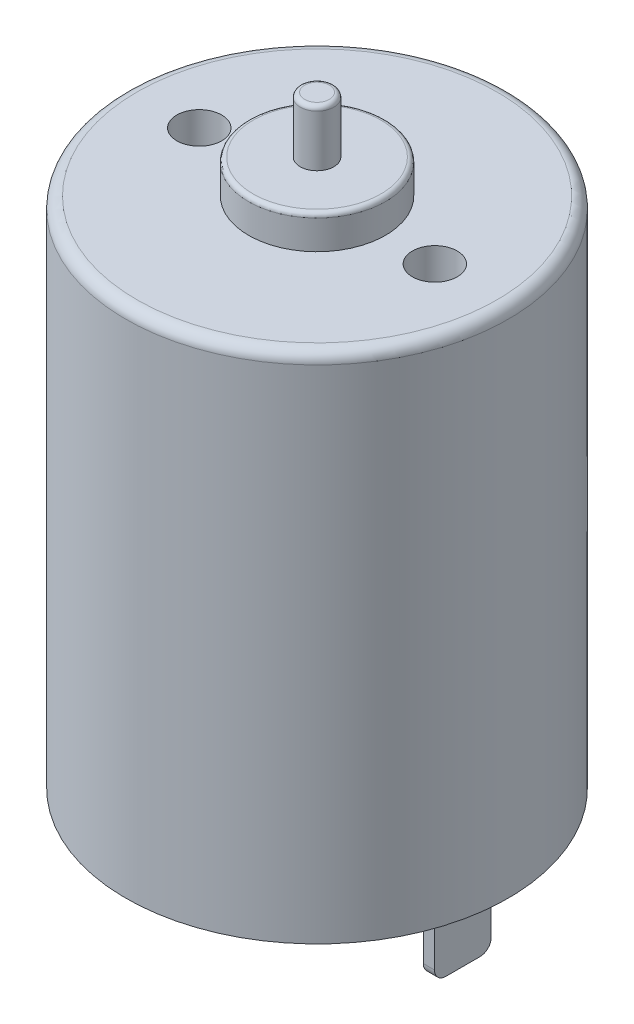
ISO-10303-21;
HEADER;
FILE_DESCRIPTION(('STEP AP214'),'2;1');
FILE_NAME('part.step','',(''),(''),'','','');
FILE_SCHEMA(('AUTOMOTIVE_DESIGN { 1 0 10303 214 1 1 1 1 }'));
ENDSEC;
DATA;
#1=APPLICATION_CONTEXT('core data for automotive mechanical design processes');
#2=APPLICATION_PROTOCOL_DEFINITION('international standard','automotive_design',2000,#1);
#3=PRODUCT_CONTEXT('',#1,'mechanical');
#4=PRODUCT('Part','Part','',(#3));
#5=PRODUCT_RELATED_PRODUCT_CATEGORY('part','',(#4));
#6=PRODUCT_DEFINITION_FORMATION('','',#4);
#7=PRODUCT_DEFINITION_CONTEXT('part definition',#1,'design');
#8=PRODUCT_DEFINITION('design','',#6,#7);
#9=PRODUCT_DEFINITION_SHAPE('','',#8);
#10=(LENGTH_UNIT() NAMED_UNIT(*) SI_UNIT(.MILLI.,.METRE.));
#11=(NAMED_UNIT(*) PLANE_ANGLE_UNIT() SI_UNIT($,.RADIAN.));
#12=(NAMED_UNIT(*) SI_UNIT($,.STERADIAN.) SOLID_ANGLE_UNIT());
#13=UNCERTAINTY_MEASURE_WITH_UNIT(LENGTH_MEASURE(1.E-05),#10,'distance_accuracy_value','');
#14=(GEOMETRIC_REPRESENTATION_CONTEXT(3) GLOBAL_UNCERTAINTY_ASSIGNED_CONTEXT((#13)) GLOBAL_UNIT_ASSIGNED_CONTEXT((#10,
#11,#12)) REPRESENTATION_CONTEXT('',''));
#15=CARTESIAN_POINT('',(0.,0.,0.));
#16=DIRECTION('',(0.,0.,1.));
#17=DIRECTION('',(1.,0.,0.));
#18=AXIS2_PLACEMENT_3D('',#15,#16,#17);
#19=CARTESIAN_POINT('',(0.,-3.65,0.));
#20=DIRECTION('',(0.,-1.,0.));
#21=DIRECTION('',(0.,0.,-1.));
#22=AXIS2_PLACEMENT_3D('',#19,#20,#21);
#23=PLANE('',#22);
#24=DIRECTION('',(-1.,0.,0.));
#25=VECTOR('',#24,1.);
#26=CARTESIAN_POINT('',(6.5,-3.65,0.765));
#27=LINE('',#26,#25);
#28=CARTESIAN_POINT('',(6.5,-3.65,0.765));
#29=VERTEX_POINT('',#28);
#30=CARTESIAN_POINT('',(6.,-3.65,0.765));
#31=VERTEX_POINT('',#30);
#32=EDGE_CURVE('E136',#29,#31,#27,.T.);
#33=ORIENTED_EDGE('',*,*,#32,.T.);
#34=DIRECTION('',(0.,0.,1.));
#35=VECTOR('',#34,1.);
#36=CARTESIAN_POINT('',(6.,-3.65,-0.765));
#37=LINE('',#36,#35);
#38=CARTESIAN_POINT('',(6.,-3.65,-0.765));
#39=VERTEX_POINT('',#38);
#40=EDGE_CURVE('E138',#39,#31,#37,.T.);
#41=ORIENTED_EDGE('',*,*,#40,.F.);
#42=DIRECTION('',(1.,0.,0.));
#43=VECTOR('',#42,1.);
#44=CARTESIAN_POINT('',(6.,-3.65,-0.765));
#45=LINE('',#44,#43);
#46=CARTESIAN_POINT('',(6.5,-3.65,-0.765));
#47=VERTEX_POINT('',#46);
#48=EDGE_CURVE('E11',#39,#47,#45,.T.);
#49=ORIENTED_EDGE('',*,*,#48,.T.);
#50=DIRECTION('',(0.,0.,-1.));
#51=VECTOR('',#50,1.);
#52=CARTESIAN_POINT('',(6.5,-3.65,0.765));
#53=LINE('',#52,#51);
#54=EDGE_CURVE('E141',#29,#47,#53,.T.);
#55=ORIENTED_EDGE('',*,*,#54,.F.);
#56=EDGE_LOOP('',(#33,#41,#49,#55));
#57=FACE_BOUND('',#56,.T.);
#58=ADVANCED_FACE('F17',(#57),#23,.T.);
#59=CARTESIAN_POINT('',(-30.75138,-3.15,-0.765));
#60=DIRECTION('',(1.,0.,0.));
#61=DIRECTION('',(0.,-1.,0.));
#62=AXIS2_PLACEMENT_3D('',#59,#60,#61);
#63=CYLINDRICAL_SURFACE('',#62,0.5);
#64=CARTESIAN_POINT('',(6.5,-3.15,-0.765));
#65=DIRECTION('',(-1.,0.,0.));
#66=DIRECTION('',(0.,0.,-1.));
#67=AXIS2_PLACEMENT_3D('',#64,#65,#66);
#68=CIRCLE('',#67,0.5);
#69=CARTESIAN_POINT('',(6.5,-3.15,-1.265));
#70=VERTEX_POINT('',#69);
#71=EDGE_CURVE('E251',#70,#47,#68,.T.);
#72=ORIENTED_EDGE('',*,*,#71,.T.);
#73=ORIENTED_EDGE('',*,*,#48,.F.);
#74=CARTESIAN_POINT('',(6.,-3.15,-0.765));
#75=DIRECTION('',(1.,0.,0.));
#76=DIRECTION('',(0.,-1.,0.));
#77=AXIS2_PLACEMENT_3D('',#74,#75,#76);
#78=CIRCLE('',#77,0.5);
#79=CARTESIAN_POINT('',(6.,-3.15,-1.265));
#80=VERTEX_POINT('',#79);
#81=EDGE_CURVE('E155',#39,#80,#78,.T.);
#82=ORIENTED_EDGE('',*,*,#81,.T.);
#83=DIRECTION('',(-1.,0.,0.));
#84=VECTOR('',#83,1.);
#85=CARTESIAN_POINT('',(6.5,-3.15,-1.265));
#86=LINE('',#85,#84);
#87=EDGE_CURVE('E27',#70,#80,#86,.T.);
#88=ORIENTED_EDGE('',*,*,#87,.F.);
#89=EDGE_LOOP('',(#72,#73,#82,#88));
#90=FACE_BOUND('',#89,.T.);
#91=ADVANCED_FACE('F426',(#90),#63,.T.);
#92=CARTESIAN_POINT('',(6.,0.,-1.265));
#93=DIRECTION('',(0.,0.,-1.));
#94=DIRECTION('',(0.,-1.,0.));
#95=AXIS2_PLACEMENT_3D('',#92,#93,#94);
#96=PLANE('',#95);
#97=ORIENTED_EDGE('',*,*,#87,.T.);
#98=DIRECTION('',(0.,1.,0.));
#99=VECTOR('',#98,1.);
#100=CARTESIAN_POINT('',(6.,-3.15,-1.265));
#101=LINE('',#100,#99);
#102=CARTESIAN_POINT('',(6.,0.,-1.265));
#103=VERTEX_POINT('',#102);
#104=EDGE_CURVE('E171',#80,#103,#101,.T.);
#105=ORIENTED_EDGE('',*,*,#104,.T.);
#106=DIRECTION('',(-1.,0.,0.));
#107=VECTOR('',#106,1.);
#108=CARTESIAN_POINT('',(6.5,0.,-1.265));
#109=LINE('',#108,#107);
#110=CARTESIAN_POINT('',(6.5,0.,-1.265));
#111=VERTEX_POINT('',#110);
#112=EDGE_CURVE('E314',#111,#103,#109,.T.);
#113=ORIENTED_EDGE('',*,*,#112,.F.);
#114=DIRECTION('',(0.,1.,0.));
#115=VECTOR('',#114,1.);
#116=CARTESIAN_POINT('',(6.5,-3.15,-1.265));
#117=LINE('',#116,#115);
#118=EDGE_CURVE('E245',#70,#111,#117,.T.);
#119=ORIENTED_EDGE('',*,*,#118,.F.);
#120=EDGE_LOOP('',(#97,#105,#113,#119));
#121=FACE_BOUND('',#120,.T.);
#122=ADVANCED_FACE('F431',(#121),#96,.T.);
#123=CARTESIAN_POINT('',(6.5,0.,-1.265));
#124=DIRECTION('',(1.,0.,0.));
#125=DIRECTION('',(0.,1.,0.));
#126=AXIS2_PLACEMENT_3D('',#123,#124,#125);
#127=PLANE('',#126);
#128=CARTESIAN_POINT('',(6.5,-3.15,0.765));
#129=DIRECTION('',(-1.,0.,0.));
#130=DIRECTION('',(0.,-1.,0.));
#131=AXIS2_PLACEMENT_3D('',#128,#129,#130);
#132=CIRCLE('',#131,0.5);
#133=CARTESIAN_POINT('',(6.5,-3.15,1.265));
#134=VERTEX_POINT('',#133);
#135=EDGE_CURVE('E147',#29,#134,#132,.T.);
#136=ORIENTED_EDGE('',*,*,#135,.F.);
#137=ORIENTED_EDGE('',*,*,#54,.T.);
#138=ORIENTED_EDGE('',*,*,#71,.F.);
#139=ORIENTED_EDGE('',*,*,#118,.T.);
#140=DIRECTION('',(0.,0.,-1.));
#141=VECTOR('',#140,1.);
#142=CARTESIAN_POINT('',(6.5,0.,1.265));
#143=LINE('',#142,#141);
#144=CARTESIAN_POINT('',(6.5,0.,1.265));
#145=VERTEX_POINT('',#144);
#146=EDGE_CURVE('E339',#145,#111,#143,.T.);
#147=ORIENTED_EDGE('',*,*,#146,.F.);
#148=DIRECTION('',(0.,1.,0.));
#149=VECTOR('',#148,1.);
#150=CARTESIAN_POINT('',(6.5,-3.15,1.265));
#151=LINE('',#150,#149);
#152=EDGE_CURVE('E328',#134,#145,#151,.T.);
#153=ORIENTED_EDGE('',*,*,#152,.F.);
#154=EDGE_LOOP('',(#136,#137,#138,#139,#147,#153));
#155=FACE_BOUND('',#154,.T.);
#156=ADVANCED_FACE('F437',(#155),#127,.T.);
#157=CARTESIAN_POINT('',(6.5,0.,1.265));
#158=DIRECTION('',(0.,0.,1.));
#159=DIRECTION('',(1.,0.,0.));
#160=AXIS2_PLACEMENT_3D('',#157,#158,#159);
#161=PLANE('',#160);
#162=DIRECTION('',(1.,0.,0.));
#163=VECTOR('',#162,1.);
#164=CARTESIAN_POINT('',(6.,-3.15,1.265));
#165=LINE('',#164,#163);
#166=CARTESIAN_POINT('',(6.,-3.15,1.265));
#167=VERTEX_POINT('',#166);
#168=EDGE_CURVE('E160',#167,#134,#165,.T.);
#169=ORIENTED_EDGE('',*,*,#168,.T.);
#170=ORIENTED_EDGE('',*,*,#152,.T.);
#171=DIRECTION('',(1.,0.,0.));
#172=VECTOR('',#171,1.);
#173=CARTESIAN_POINT('',(6.,0.,1.265));
#174=LINE('',#173,#172);
#175=CARTESIAN_POINT('',(6.,0.,1.265));
#176=VERTEX_POINT('',#175);
#177=EDGE_CURVE('E177',#176,#145,#174,.T.);
#178=ORIENTED_EDGE('',*,*,#177,.F.);
#179=DIRECTION('',(0.,1.,0.));
#180=VECTOR('',#179,1.);
#181=CARTESIAN_POINT('',(6.,-3.15,1.265));
#182=LINE('',#181,#180);
#183=EDGE_CURVE('E163',#167,#176,#182,.T.);
#184=ORIENTED_EDGE('',*,*,#183,.F.);
#185=EDGE_LOOP('',(#169,#170,#178,#184));
#186=FACE_BOUND('',#185,.T.);
#187=ADVANCED_FACE('F481',(#186),#161,.T.);
#188=CARTESIAN_POINT('',(30.75138,-3.15,0.765));
#189=DIRECTION('',(-1.,0.,0.));
#190=DIRECTION('',(0.,-1.,0.));
#191=AXIS2_PLACEMENT_3D('',#188,#189,#190);
#192=CYLINDRICAL_SURFACE('',#191,0.5);
#193=CARTESIAN_POINT('',(6.,-3.15,0.765));
#194=DIRECTION('',(1.,0.,0.));
#195=DIRECTION('',(0.,0.,1.));
#196=AXIS2_PLACEMENT_3D('',#193,#194,#195);
#197=CIRCLE('',#196,0.5);
#198=EDGE_CURVE('E153',#167,#31,#197,.T.);
#199=ORIENTED_EDGE('',*,*,#198,.T.);
#200=ORIENTED_EDGE('',*,*,#32,.F.);
#201=ORIENTED_EDGE('',*,*,#135,.T.);
#202=ORIENTED_EDGE('',*,*,#168,.F.);
#203=EDGE_LOOP('',(#199,#200,#201,#202));
#204=FACE_BOUND('',#203,.T.);
#205=ADVANCED_FACE('F158',(#204),#192,.T.);
#206=CARTESIAN_POINT('',(6.,0.,1.265));
#207=DIRECTION('',(-1.,0.,0.));
#208=DIRECTION('',(0.,0.,1.));
#209=AXIS2_PLACEMENT_3D('',#206,#207,#208);
#210=PLANE('',#209);
#211=ORIENTED_EDGE('',*,*,#198,.F.);
#212=ORIENTED_EDGE('',*,*,#183,.T.);
#213=DIRECTION('',(0.,0.,1.));
#214=VECTOR('',#213,1.);
#215=CARTESIAN_POINT('',(6.,0.,-1.265));
#216=LINE('',#215,#214);
#217=EDGE_CURVE('E282',#103,#176,#216,.T.);
#218=ORIENTED_EDGE('',*,*,#217,.F.);
#219=ORIENTED_EDGE('',*,*,#104,.F.);
#220=ORIENTED_EDGE('',*,*,#81,.F.);
#221=ORIENTED_EDGE('',*,*,#40,.T.);
#222=EDGE_LOOP('',(#211,#212,#218,#219,#220,#221));
#223=FACE_BOUND('',#222,.T.);
#224=ADVANCED_FACE('F151',(#223),#210,.T.);
#225=CARTESIAN_POINT('',(-6.,0.,1.265));
#226=DIRECTION('',(0.,0.,1.));
#227=DIRECTION('',(1.,0.,0.));
#228=AXIS2_PLACEMENT_3D('',#225,#226,#227);
#229=PLANE('',#228);
#230=DIRECTION('',(1.,0.,0.));
#231=VECTOR('',#230,1.);
#232=CARTESIAN_POINT('',(-6.5,-3.15,1.265));
#233=LINE('',#232,#231);
#234=CARTESIAN_POINT('',(-6.5,-3.15,1.265));
#235=VERTEX_POINT('',#234);
#236=CARTESIAN_POINT('',(-6.,-3.15,1.265));
#237=VERTEX_POINT('',#236);
#238=EDGE_CURVE('E212',#235,#237,#233,.T.);
#239=ORIENTED_EDGE('',*,*,#238,.T.);
#240=DIRECTION('',(0.,1.,0.));
#241=VECTOR('',#240,1.);
#242=CARTESIAN_POINT('',(-6.,-3.15,1.265));
#243=LINE('',#242,#241);
#244=CARTESIAN_POINT('',(-6.,0.,1.265));
#245=VERTEX_POINT('',#244);
#246=EDGE_CURVE('E201',#237,#245,#243,.T.);
#247=ORIENTED_EDGE('',*,*,#246,.T.);
#248=DIRECTION('',(1.,0.,0.));
#249=VECTOR('',#248,1.);
#250=CARTESIAN_POINT('',(-6.5,0.,1.265));
#251=LINE('',#250,#249);
#252=CARTESIAN_POINT('',(-6.5,0.,1.265));
#253=VERTEX_POINT('',#252);
#254=EDGE_CURVE('E286',#253,#245,#251,.T.);
#255=ORIENTED_EDGE('',*,*,#254,.F.);
#256=DIRECTION('',(0.,1.,0.));
#257=VECTOR('',#256,1.);
#258=CARTESIAN_POINT('',(-6.5,-3.15,1.265));
#259=LINE('',#258,#257);
#260=EDGE_CURVE('E215',#235,#253,#259,.T.);
#261=ORIENTED_EDGE('',*,*,#260,.F.);
#262=EDGE_LOOP('',(#239,#247,#255,#261));
#263=FACE_BOUND('',#262,.T.);
#264=ADVANCED_FACE('F473',(#263),#229,.T.);
#265=CARTESIAN_POINT('',(-6.5,0.,-1.265));
#266=DIRECTION('',(0.,0.,-1.));
#267=DIRECTION('',(0.,-1.,0.));
#268=AXIS2_PLACEMENT_3D('',#265,#266,#267);
#269=PLANE('',#268);
#270=DIRECTION('',(-1.,0.,0.));
#271=VECTOR('',#270,1.);
#272=CARTESIAN_POINT('',(-6.,-3.15,-1.265));
#273=LINE('',#272,#271);
#274=CARTESIAN_POINT('',(-6.,-3.15,-1.265));
#275=VERTEX_POINT('',#274);
#276=CARTESIAN_POINT('',(-6.5,-3.15,-1.265));
#277=VERTEX_POINT('',#276);
#278=EDGE_CURVE('E164',#275,#277,#273,.T.);
#279=ORIENTED_EDGE('',*,*,#278,.T.);
#280=DIRECTION('',(0.,1.,0.));
#281=VECTOR('',#280,1.);
#282=CARTESIAN_POINT('',(-6.5,-3.15,-1.265));
#283=LINE('',#282,#281);
#284=CARTESIAN_POINT('',(-6.5,0.,-1.265));
#285=VERTEX_POINT('',#284);
#286=EDGE_CURVE('E334',#277,#285,#283,.T.);
#287=ORIENTED_EDGE('',*,*,#286,.T.);
#288=DIRECTION('',(-1.,0.,0.));
#289=VECTOR('',#288,1.);
#290=CARTESIAN_POINT('',(-6.,0.,-1.265));
#291=LINE('',#290,#289);
#292=CARTESIAN_POINT('',(-6.,0.,-1.265));
#293=VERTEX_POINT('',#292);
#294=EDGE_CURVE('E209',#293,#285,#291,.T.);
#295=ORIENTED_EDGE('',*,*,#294,.F.);
#296=DIRECTION('',(0.,1.,0.));
#297=VECTOR('',#296,1.);
#298=CARTESIAN_POINT('',(-6.,-3.15,-1.265));
#299=LINE('',#298,#297);
#300=EDGE_CURVE('E197',#275,#293,#299,.T.);
#301=ORIENTED_EDGE('',*,*,#300,.F.);
#302=EDGE_LOOP('',(#279,#287,#295,#301));
#303=FACE_BOUND('',#302,.T.);
#304=ADVANCED_FACE('F467',(#303),#269,.T.);
#305=CARTESIAN_POINT('',(-30.75138,-3.15,-0.765));
#306=DIRECTION('',(1.,0.,0.));
#307=DIRECTION('',(0.,-1.,0.));
#308=AXIS2_PLACEMENT_3D('',#305,#306,#307);
#309=CYLINDRICAL_SURFACE('',#308,0.5);
#310=CARTESIAN_POINT('',(-6.,-3.15,-0.765));
#311=DIRECTION('',(-1.,0.,0.));
#312=DIRECTION('',(0.,0.,-1.));
#313=AXIS2_PLACEMENT_3D('',#310,#311,#312);
#314=CIRCLE('',#313,0.5);
#315=CARTESIAN_POINT('',(-6.,-3.65,-0.765));
#316=VERTEX_POINT('',#315);
#317=EDGE_CURVE('E202',#275,#316,#314,.T.);
#318=ORIENTED_EDGE('',*,*,#317,.T.);
#319=DIRECTION('',(1.,0.,0.));
#320=VECTOR('',#319,1.);
#321=CARTESIAN_POINT('',(-6.5,-3.65,-0.765));
#322=LINE('',#321,#320);
#323=CARTESIAN_POINT('',(-6.5,-3.65,-0.765));
#324=VERTEX_POINT('',#323);
#325=EDGE_CURVE('E173',#324,#316,#322,.T.);
#326=ORIENTED_EDGE('',*,*,#325,.F.);
#327=CARTESIAN_POINT('',(-6.5,-3.15,-0.765));
#328=DIRECTION('',(1.,0.,0.));
#329=DIRECTION('',(0.,-1.,0.));
#330=AXIS2_PLACEMENT_3D('',#327,#328,#329);
#331=CIRCLE('',#330,0.5);
#332=EDGE_CURVE('E329',#324,#277,#331,.T.);
#333=ORIENTED_EDGE('',*,*,#332,.T.);
#334=ORIENTED_EDGE('',*,*,#278,.F.);
#335=EDGE_LOOP('',(#318,#326,#333,#334));
#336=FACE_BOUND('',#335,.T.);
#337=ADVANCED_FACE('F463',(#336),#309,.T.);
#338=CARTESIAN_POINT('',(0.,-3.65,0.));
#339=DIRECTION('',(0.,-1.,0.));
#340=DIRECTION('',(0.,0.,-1.));
#341=AXIS2_PLACEMENT_3D('',#338,#339,#340);
#342=PLANE('',#341);
#343=DIRECTION('',(-1.,0.,0.));
#344=VECTOR('',#343,1.);
#345=CARTESIAN_POINT('',(-6.,-3.65,0.765));
#346=LINE('',#345,#344);
#347=CARTESIAN_POINT('',(-6.,-3.65,0.765));
#348=VERTEX_POINT('',#347);
#349=CARTESIAN_POINT('',(-6.5,-3.65,0.765));
#350=VERTEX_POINT('',#349);
#351=EDGE_CURVE('E216',#348,#350,#346,.T.);
#352=ORIENTED_EDGE('',*,*,#351,.T.);
#353=DIRECTION('',(0.,0.,1.));
#354=VECTOR('',#353,1.);
#355=CARTESIAN_POINT('',(-6.5,-3.65,-0.765));
#356=LINE('',#355,#354);
#357=EDGE_CURVE('E333',#324,#350,#356,.T.);
#358=ORIENTED_EDGE('',*,*,#357,.F.);
#359=ORIENTED_EDGE('',*,*,#325,.T.);
#360=DIRECTION('',(0.,0.,-1.));
#361=VECTOR('',#360,1.);
#362=CARTESIAN_POINT('',(-6.,-3.65,0.765));
#363=LINE('',#362,#361);
#364=EDGE_CURVE('E304',#348,#316,#363,.T.);
#365=ORIENTED_EDGE('',*,*,#364,.F.);
#366=EDGE_LOOP('',(#352,#358,#359,#365));
#367=FACE_BOUND('',#366,.T.);
#368=ADVANCED_FACE('F466',(#367),#342,.T.);
#369=CARTESIAN_POINT('',(-6.5,0.,1.265));
#370=DIRECTION('',(-1.,0.,0.));
#371=DIRECTION('',(0.,0.,1.));
#372=AXIS2_PLACEMENT_3D('',#369,#370,#371);
#373=PLANE('',#372);
#374=CARTESIAN_POINT('',(-6.5,-3.15,0.765));
#375=DIRECTION('',(1.,0.,0.));
#376=DIRECTION('',(0.,0.,1.));
#377=AXIS2_PLACEMENT_3D('',#374,#375,#376);
#378=CIRCLE('',#377,0.5);
#379=EDGE_CURVE('E227',#235,#350,#378,.T.);
#380=ORIENTED_EDGE('',*,*,#379,.F.);
#381=ORIENTED_EDGE('',*,*,#260,.T.);
#382=DIRECTION('',(0.,0.,1.));
#383=VECTOR('',#382,1.);
#384=CARTESIAN_POINT('',(-6.5,0.,-1.265));
#385=LINE('',#384,#383);
#386=EDGE_CURVE('E297',#285,#253,#385,.T.);
#387=ORIENTED_EDGE('',*,*,#386,.F.);
#388=ORIENTED_EDGE('',*,*,#286,.F.);
#389=ORIENTED_EDGE('',*,*,#332,.F.);
#390=ORIENTED_EDGE('',*,*,#357,.T.);
#391=EDGE_LOOP('',(#380,#381,#387,#388,#389,#390));
#392=FACE_BOUND('',#391,.T.);
#393=ADVANCED_FACE('F490',(#392),#373,.T.);
#394=CARTESIAN_POINT('',(30.75138,-3.15,0.765));
#395=DIRECTION('',(-1.,0.,0.));
#396=DIRECTION('',(0.,-1.,0.));
#397=AXIS2_PLACEMENT_3D('',#394,#395,#396);
#398=CYLINDRICAL_SURFACE('',#397,0.5);
#399=ORIENTED_EDGE('',*,*,#379,.T.);
#400=ORIENTED_EDGE('',*,*,#351,.F.);
#401=CARTESIAN_POINT('',(-6.,-3.15,0.765));
#402=DIRECTION('',(-1.,0.,0.));
#403=DIRECTION('',(0.,-1.,0.));
#404=AXIS2_PLACEMENT_3D('',#401,#402,#403);
#405=CIRCLE('',#404,0.5);
#406=EDGE_CURVE('E308',#348,#237,#405,.T.);
#407=ORIENTED_EDGE('',*,*,#406,.T.);
#408=ORIENTED_EDGE('',*,*,#238,.F.);
#409=EDGE_LOOP('',(#399,#400,#407,#408));
#410=FACE_BOUND('',#409,.T.);
#411=ADVANCED_FACE('F726',(#410),#398,.T.);
#412=CARTESIAN_POINT('',(-6.,0.,-1.265));
#413=DIRECTION('',(1.,0.,0.));
#414=DIRECTION('',(0.,1.,0.));
#415=AXIS2_PLACEMENT_3D('',#412,#413,#414);
#416=PLANE('',#415);
#417=ORIENTED_EDGE('',*,*,#406,.F.);
#418=ORIENTED_EDGE('',*,*,#364,.T.);
#419=ORIENTED_EDGE('',*,*,#317,.F.);
#420=ORIENTED_EDGE('',*,*,#300,.T.);
#421=DIRECTION('',(0.,0.,-1.));
#422=VECTOR('',#421,1.);
#423=CARTESIAN_POINT('',(-6.,0.,1.265));
#424=LINE('',#423,#422);
#425=EDGE_CURVE('E206',#245,#293,#424,.T.);
#426=ORIENTED_EDGE('',*,*,#425,.F.);
#427=ORIENTED_EDGE('',*,*,#246,.F.);
#428=EDGE_LOOP('',(#417,#418,#419,#420,#426,#427));
#429=FACE_BOUND('',#428,.T.);
#430=ADVANCED_FACE('F493',(#429),#416,.T.);
#431=CARTESIAN_POINT('',(0.,-1.6,0.));
#432=DIRECTION('',(0.,-1.,0.));
#433=DIRECTION('',(0.,0.,-1.));
#434=AXIS2_PLACEMENT_3D('',#431,#432,#433);
#435=PLANE('',#434);
#436=CARTESIAN_POINT('',(0.,-1.6,0.));
#437=DIRECTION('',(0.,1.,0.));
#438=DIRECTION('',(0.,0.,-1.));
#439=AXIS2_PLACEMENT_3D('',#436,#437,#438);
#440=CIRCLE('',#439,1.85);
#441=CARTESIAN_POINT('',(-0.04509191772104,-1.6,-1.84945038294));
#442=VERTEX_POINT('',#441);
#443=EDGE_CURVE('E281',#442,#442,#440,.T.);
#444=ORIENTED_EDGE('',*,*,#443,.F.);
#445=EDGE_LOOP('',(#444));
#446=FACE_BOUND('',#445,.T.);
#447=ADVANCED_FACE('F456',(#446),#435,.T.);
#448=CARTESIAN_POINT('',(0.,-1.1,0.));
#449=DIRECTION('',(0.,-1.,0.));
#450=DIRECTION('',(0.02437400957894,0.,0.999702909697199));
#451=AXIS2_PLACEMENT_3D('',#448,#449,#450);
#452=TOROIDAL_SURFACE('',#451,1.85,0.5);
#453=ORIENTED_EDGE('',*,*,#443,.T.);
#454=CARTESIAN_POINT('',(-0.0450919177210387,-1.1,-1.84945038293982));
#455=DIRECTION('',(0.999702909697199,0.,-0.0243740095789399));
#456=DIRECTION('',(-0.0243740095789399,0.,-0.999702909697199));
#457=AXIS2_PLACEMENT_3D('',#454,#455,#456);
#458=CIRCLE('',#457,0.5);
#459=CARTESIAN_POINT('',(-0.0572789225105087,-1.1,-2.34930183778842));
#460=VERTEX_POINT('',#459);
#461=EDGE_CURVE('E338',#442,#460,#458,.T.);
#462=ORIENTED_EDGE('',*,*,#461,.T.);
#463=CARTESIAN_POINT('',(0.,-1.1,0.));
#464=DIRECTION('',(0.,1.,0.));
#465=DIRECTION('',(-4.029189238517E-11,0.,-1.));
#466=AXIS2_PLACEMENT_3D('',#463,#464,#465);
#467=CIRCLE('',#466,2.35);
#468=CARTESIAN_POINT('',(-9.468594710514E-11,-1.1,-2.35));
#469=VERTEX_POINT('',#468);
#470=EDGE_CURVE('E243',#469,#460,#467,.T.);
#471=ORIENTED_EDGE('',*,*,#470,.F.);
#472=CARTESIAN_POINT('',(0.,-1.1,0.));
#473=DIRECTION('',(0.,1.,0.));
#474=DIRECTION('',(-4.029189238517E-11,0.,-1.));
#475=AXIS2_PLACEMENT_3D('',#472,#473,#474);
#476=CIRCLE('',#475,2.35);
#477=EDGE_CURVE('E239',#460,#469,#476,.T.);
#478=ORIENTED_EDGE('',*,*,#477,.F.);
#479=ORIENTED_EDGE('',*,*,#461,.F.);
#480=EDGE_LOOP('',(#453,#462,#471,#478,#479));
#481=FACE_BOUND('',#480,.T.);
#482=ADVANCED_FACE('F452',(#481),#452,.T.);
#483=CARTESIAN_POINT('',(0.,0.,0.));
#484=DIRECTION('',(0.,-1.,0.));
#485=DIRECTION('',(0.,0.,1.));
#486=AXIS2_PLACEMENT_3D('',#483,#484,#485);
#487=CYLINDRICAL_SURFACE('',#486,2.35);
#488=ORIENTED_EDGE('',*,*,#470,.T.);
#489=ORIENTED_EDGE('',*,*,#477,.T.);
#490=DIRECTION('',(0.,1.,0.));
#491=VECTOR('',#490,1.);
#492=CARTESIAN_POINT('',(0.,0.,-2.35));
#493=LINE('',#492,#491);
#494=CARTESIAN_POINT('',(0.,0.,-2.35));
#495=VERTEX_POINT('',#494);
#496=EDGE_CURVE('E242',#469,#495,#493,.T.);
#497=ORIENTED_EDGE('',*,*,#496,.T.);
#498=CARTESIAN_POINT('',(0.,0.,0.));
#499=DIRECTION('',(0.,-1.,0.));
#500=DIRECTION('',(0.,0.,1.));
#501=AXIS2_PLACEMENT_3D('',#498,#499,#500);
#502=CIRCLE('',#501,2.35);
#503=EDGE_CURVE('E210',#495,#495,#502,.T.);
#504=ORIENTED_EDGE('',*,*,#503,.T.);
#505=ORIENTED_EDGE('',*,*,#496,.F.);
#506=EDGE_LOOP('',(#488,#489,#497,#504,#505));
#507=FACE_BOUND('',#506,.T.);
#508=ADVANCED_FACE('F455',(#507),#487,.T.);
#509=CARTESIAN_POINT('',(0.,20.85,0.));
#510=DIRECTION('',(0.,1.,0.));
#511=DIRECTION('',(1.,0.,0.));
#512=AXIS2_PLACEMENT_3D('',#509,#510,#511);
#513=PLANE('',#512);
#514=CARTESIAN_POINT('',(5.25,20.85,0.));
#515=DIRECTION('',(0.,-1.,0.));
#516=DIRECTION('',(-1.,0.,0.));
#517=AXIS2_PLACEMENT_3D('',#514,#515,#516);
#518=CIRCLE('',#517,1.);
#519=CARTESIAN_POINT('',(4.25,20.85,0.));
#520=VERTEX_POINT('',#519);
#521=EDGE_CURVE('E179',#520,#520,#518,.T.);
#522=ORIENTED_EDGE('',*,*,#521,.F.);
#523=EDGE_LOOP('',(#522));
#524=FACE_BOUND('',#523,.T.);
#525=ADVANCED_FACE('F503',(#524),#513,.T.);
#526=CARTESIAN_POINT('',(5.25,22.85,0.));
#527=DIRECTION('',(0.,1.,0.));
#528=DIRECTION('',(1.,0.,0.));
#529=AXIS2_PLACEMENT_3D('',#526,#527,#528);
#530=CYLINDRICAL_SURFACE('',#529,1.);
#531=ORIENTED_EDGE('',*,*,#521,.T.);
#532=DIRECTION('',(0.,1.,0.));
#533=VECTOR('',#532,1.);
#534=CARTESIAN_POINT('',(4.25,22.85,0.));
#535=LINE('',#534,#533);
#536=CARTESIAN_POINT('',(4.25,22.85,0.));
#537=VERTEX_POINT('',#536);
#538=EDGE_CURVE('E183',#520,#537,#535,.T.);
#539=ORIENTED_EDGE('',*,*,#538,.T.);
#540=CARTESIAN_POINT('',(5.25,22.85,0.));
#541=DIRECTION('',(0.,1.,0.));
#542=DIRECTION('',(1.,0.,0.));
#543=AXIS2_PLACEMENT_3D('',#540,#541,#542);
#544=CIRCLE('',#543,1.);
#545=EDGE_CURVE('E354',#537,#537,#544,.T.);
#546=ORIENTED_EDGE('',*,*,#545,.T.);
#547=ORIENTED_EDGE('',*,*,#538,.F.);
#548=EDGE_LOOP('',(#531,#539,#546,#547));
#549=FACE_BOUND('',#548,.T.);
#550=ADVANCED_FACE('F501',(#549),#530,.F.);
#551=CARTESIAN_POINT('',(0.,20.85,0.));
#552=DIRECTION('',(0.,1.,0.));
#553=DIRECTION('',(1.,0.,0.));
#554=AXIS2_PLACEMENT_3D('',#551,#552,#553);
#555=PLANE('',#554);
#556=CARTESIAN_POINT('',(-5.25,20.85,0.));
#557=DIRECTION('',(0.,-1.,0.));
#558=DIRECTION('',(-1.,0.,0.));
#559=AXIS2_PLACEMENT_3D('',#556,#557,#558);
#560=CIRCLE('',#559,1.);
#561=CARTESIAN_POINT('',(-6.25,20.85,0.));
#562=VERTEX_POINT('',#561);
#563=EDGE_CURVE('E195',#562,#562,#560,.T.);
#564=ORIENTED_EDGE('',*,*,#563,.F.);
#565=EDGE_LOOP('',(#564));
#566=FACE_BOUND('',#565,.T.);
#567=ADVANCED_FACE('F447',(#566),#555,.T.);
#568=CARTESIAN_POINT('',(-5.25,22.85,0.));
#569=DIRECTION('',(0.,1.,0.));
#570=DIRECTION('',(1.,0.,0.));
#571=AXIS2_PLACEMENT_3D('',#568,#569,#570);
#572=CYLINDRICAL_SURFACE('',#571,1.);
#573=ORIENTED_EDGE('',*,*,#563,.T.);
#574=DIRECTION('',(0.,1.,0.));
#575=VECTOR('',#574,1.);
#576=CARTESIAN_POINT('',(-6.25,22.85,0.));
#577=LINE('',#576,#575);
#578=CARTESIAN_POINT('',(-6.25,22.85,0.));
#579=VERTEX_POINT('',#578);
#580=EDGE_CURVE('E184',#562,#579,#577,.T.);
#581=ORIENTED_EDGE('',*,*,#580,.T.);
#582=CARTESIAN_POINT('',(-5.25,22.85,0.));
#583=DIRECTION('',(0.,1.,0.));
#584=DIRECTION('',(1.,0.,0.));
#585=AXIS2_PLACEMENT_3D('',#582,#583,#584);
#586=CIRCLE('',#585,1.);
#587=EDGE_CURVE('E20',#579,#579,#586,.T.);
#588=ORIENTED_EDGE('',*,*,#587,.T.);
#589=ORIENTED_EDGE('',*,*,#580,.F.);
#590=EDGE_LOOP('',(#573,#581,#588,#589));
#591=FACE_BOUND('',#590,.T.);
#592=ADVANCED_FACE('F443',(#591),#572,.F.);
#593=CARTESIAN_POINT('',(0.,26.85,0.));
#594=DIRECTION('',(0.,1.,0.));
#595=DIRECTION('',(1.,0.,0.));
#596=AXIS2_PLACEMENT_3D('',#593,#594,#595);
#597=PLANE('',#596);
#598=CARTESIAN_POINT('',(0.,26.85,0.));
#599=DIRECTION('',(0.,-1.,0.));
#600=DIRECTION('',(-1.,0.,0.));
#601=AXIS2_PLACEMENT_3D('',#598,#599,#600);
#602=CIRCLE('',#601,0.55);
#603=CARTESIAN_POINT('',(-0.5482536548657,26.85,-0.04379417685535));
#604=VERTEX_POINT('',#603);
#605=EDGE_CURVE('E196',#604,#604,#602,.T.);
#606=ORIENTED_EDGE('',*,*,#605,.F.);
#607=EDGE_LOOP('',(#606));
#608=FACE_BOUND('',#607,.T.);
#609=ADVANCED_FACE('F446',(#608),#597,.T.);
#610=CARTESIAN_POINT('',(0.,26.65,0.));
#611=DIRECTION('',(0.,1.,0.));
#612=DIRECTION('',(0.996824827028486,0.,0.0796257761006389));
#613=AXIS2_PLACEMENT_3D('',#610,#611,#612);
#614=TOROIDAL_SURFACE('',#613,0.55,0.2);
#615=ORIENTED_EDGE('',*,*,#605,.T.);
#616=CARTESIAN_POINT('',(-0.548253654865667,26.65,-0.0437941768553513));
#617=DIRECTION('',(-0.0796257761006388,0.,0.996824827028486));
#618=DIRECTION('',(-0.996824827028486,0.,-0.0796257761006388));
#619=AXIS2_PLACEMENT_3D('',#616,#617,#618);
#620=CIRCLE('',#619,0.2);
#621=CARTESIAN_POINT('',(-0.7476186202714,26.65,-0.05971933207548));
#622=VERTEX_POINT('',#621);
#623=EDGE_CURVE('E191',#604,#622,#620,.T.);
#624=ORIENTED_EDGE('',*,*,#623,.T.);
#625=CARTESIAN_POINT('',(0.,26.65,0.));
#626=DIRECTION('',(0.,-1.,0.));
#627=DIRECTION('',(-1.,0.,-1.625375956389E-09));
#628=AXIS2_PLACEMENT_3D('',#625,#626,#627);
#629=CIRCLE('',#628,0.75);
#630=CARTESIAN_POINT('',(-0.75,26.65,0.));
#631=VERTEX_POINT('',#630);
#632=EDGE_CURVE('E271',#631,#622,#629,.T.);
#633=ORIENTED_EDGE('',*,*,#632,.F.);
#634=CARTESIAN_POINT('',(0.,26.65,0.));
#635=DIRECTION('',(0.,-1.,0.));
#636=DIRECTION('',(-1.,0.,-1.625375956389E-09));
#637=AXIS2_PLACEMENT_3D('',#634,#635,#636);
#638=CIRCLE('',#637,0.75);
#639=EDGE_CURVE('E264',#622,#631,#638,.T.);
#640=ORIENTED_EDGE('',*,*,#639,.F.);
#641=ORIENTED_EDGE('',*,*,#623,.F.);
#642=EDGE_LOOP('',(#615,#624,#633,#640,#641));
#643=FACE_BOUND('',#642,.T.);
#644=ADVANCED_FACE('F419',(#643),#614,.T.);
#645=CARTESIAN_POINT('',(0.,24.6,0.));
#646=DIRECTION('',(0.,1.,0.));
#647=DIRECTION('',(1.,0.,0.));
#648=AXIS2_PLACEMENT_3D('',#645,#646,#647);
#649=CYLINDRICAL_SURFACE('',#648,0.75);
#650=ORIENTED_EDGE('',*,*,#639,.T.);
#651=DIRECTION('',(0.,-1.,0.));
#652=VECTOR('',#651,1.);
#653=CARTESIAN_POINT('',(-0.75,24.6,0.));
#654=LINE('',#653,#652);
#655=CARTESIAN_POINT('',(-0.75,24.35,0.));
#656=VERTEX_POINT('',#655);
#657=EDGE_CURVE('E268',#631,#656,#654,.T.);
#658=ORIENTED_EDGE('',*,*,#657,.T.);
#659=CARTESIAN_POINT('',(0.,24.35,0.));
#660=DIRECTION('',(0.,1.,0.));
#661=DIRECTION('',(1.,0.,0.));
#662=AXIS2_PLACEMENT_3D('',#659,#660,#661);
#663=CIRCLE('',#662,0.75);
#664=EDGE_CURVE('E237',#656,#656,#663,.T.);
#665=ORIENTED_EDGE('',*,*,#664,.T.);
#666=ORIENTED_EDGE('',*,*,#657,.F.);
#667=ORIENTED_EDGE('',*,*,#632,.T.);
#668=EDGE_LOOP('',(#650,#658,#665,#666,#667));
#669=FACE_BOUND('',#668,.T.);
#670=ADVANCED_FACE('F408',(#669),#649,.T.);
#671=CARTESIAN_POINT('',(0.,24.35,0.));
#672=DIRECTION('',(0.,1.,0.));
#673=DIRECTION('',(1.,0.,0.));
#674=AXIS2_PLACEMENT_3D('',#671,#672,#673);
#675=PLANE('',#674);
#676=ORIENTED_EDGE('',*,*,#664,.F.);
#677=EDGE_LOOP('',(#676));
#678=FACE_BOUND('',#677,.T.);
#679=CARTESIAN_POINT('',(0.,24.35,0.));
#680=DIRECTION('',(0.,-1.,0.));
#681=DIRECTION('',(-1.,0.,0.));
#682=AXIS2_PLACEMENT_3D('',#679,#680,#681);
#683=CIRCLE('',#682,2.85);
#684=CARTESIAN_POINT('',(-2.849452541563,24.35,-0.05585887020462));
#685=VERTEX_POINT('',#684);
#686=EDGE_CURVE('E238',#685,#685,#683,.T.);
#687=ORIENTED_EDGE('',*,*,#686,.F.);
#688=EDGE_LOOP('',(#687));
#689=FACE_BOUND('',#688,.T.);
#690=ADVANCED_FACE('F406',(#678,#689),#675,.T.);
#691=CARTESIAN_POINT('',(0.,24.15,0.));
#692=DIRECTION('',(0.,1.,0.));
#693=DIRECTION('',(0.999807909320328,0.,0.0195996035805705));
#694=AXIS2_PLACEMENT_3D('',#691,#692,#693);
#695=TOROIDAL_SURFACE('',#694,2.85,0.2);
#696=ORIENTED_EDGE('',*,*,#686,.T.);
#697=CARTESIAN_POINT('',(-2.84945254156293,24.15,-0.0558588702046257));
#698=DIRECTION('',(-0.0195996035805704,0.,0.999807909320328));
#699=DIRECTION('',(-0.999807909320328,0.,-0.0195996035805704));
#700=AXIS2_PLACEMENT_3D('',#697,#698,#699);
#701=CIRCLE('',#700,0.2);
#702=CARTESIAN_POINT('',(-3.049414123427,24.15,-0.05977879092074));
#703=VERTEX_POINT('',#702);
#704=EDGE_CURVE('E233',#685,#703,#701,.T.);
#705=ORIENTED_EDGE('',*,*,#704,.T.);
#706=CARTESIAN_POINT('',(0.,24.15,0.));
#707=DIRECTION('',(0.,-1.,0.));
#708=DIRECTION('',(-1.,0.,-3.180223896046E-11));
#709=AXIS2_PLACEMENT_3D('',#706,#707,#708);
#710=CIRCLE('',#709,3.05);
#711=CARTESIAN_POINT('',(-3.05,24.15,0.));
#712=VERTEX_POINT('',#711);
#713=EDGE_CURVE('E292',#712,#703,#710,.T.);
#714=ORIENTED_EDGE('',*,*,#713,.F.);
#715=CARTESIAN_POINT('',(0.,24.15,0.));
#716=DIRECTION('',(0.,-1.,0.));
#717=DIRECTION('',(-1.,0.,-3.180223896046E-11));
#718=AXIS2_PLACEMENT_3D('',#715,#716,#717);
#719=CIRCLE('',#718,3.05);
#720=EDGE_CURVE('E293',#703,#712,#719,.T.);
#721=ORIENTED_EDGE('',*,*,#720,.F.);
#722=ORIENTED_EDGE('',*,*,#704,.F.);
#723=EDGE_LOOP('',(#696,#705,#714,#721,#722));
#724=FACE_BOUND('',#723,.T.);
#725=ADVANCED_FACE('F401',(#724),#695,.T.);
#726=CARTESIAN_POINT('',(0.,0.,0.));
#727=DIRECTION('',(0.,1.,0.));
#728=DIRECTION('',(1.,0.,0.));
#729=AXIS2_PLACEMENT_3D('',#726,#727,#728);
#730=CYLINDRICAL_SURFACE('',#729,3.05);
#731=ORIENTED_EDGE('',*,*,#720,.T.);
#732=DIRECTION('',(0.,-1.,0.));
#733=VECTOR('',#732,1.);
#734=CARTESIAN_POINT('',(-3.05,0.,0.));
#735=LINE('',#734,#733);
#736=CARTESIAN_POINT('',(-3.05,22.85,0.));
#737=VERTEX_POINT('',#736);
#738=EDGE_CURVE('E289',#712,#737,#735,.T.);
#739=ORIENTED_EDGE('',*,*,#738,.T.);
#740=CARTESIAN_POINT('',(0.,22.85,0.));
#741=DIRECTION('',(0.,1.,0.));
#742=DIRECTION('',(1.,0.,0.));
#743=AXIS2_PLACEMENT_3D('',#740,#741,#742);
#744=CIRCLE('',#743,3.05);
#745=EDGE_CURVE('E228',#737,#737,#744,.T.);
#746=ORIENTED_EDGE('',*,*,#745,.T.);
#747=ORIENTED_EDGE('',*,*,#738,.F.);
#748=ORIENTED_EDGE('',*,*,#713,.T.);
#749=EDGE_LOOP('',(#731,#739,#746,#747,#748));
#750=FACE_BOUND('',#749,.T.);
#751=ADVANCED_FACE('F417',(#750),#730,.T.);
#752=CARTESIAN_POINT('',(0.,22.85,0.));
#753=DIRECTION('',(0.,1.,0.));
#754=DIRECTION('',(1.,0.,0.));
#755=AXIS2_PLACEMENT_3D('',#752,#753,#754);
#756=PLANE('',#755);
#757=ORIENTED_EDGE('',*,*,#545,.F.);
#758=EDGE_LOOP('',(#757));
#759=FACE_BOUND('',#758,.T.);
#760=ORIENTED_EDGE('',*,*,#587,.F.);
#761=EDGE_LOOP('',(#760));
#762=FACE_BOUND('',#761,.T.);
#763=ORIENTED_EDGE('',*,*,#745,.F.);
#764=EDGE_LOOP('',(#763));
#765=FACE_BOUND('',#764,.T.);
#766=CARTESIAN_POINT('',(0.,22.85,0.));
#767=DIRECTION('',(0.,1.,0.));
#768=DIRECTION('',(-0.999979963256423,0.,-0.00633033061406515));
#769=AXIS2_PLACEMENT_3D('',#766,#767,#768);
#770=CIRCLE('',#769,8.025);
#771=CARTESIAN_POINT('',(-8.02483035281121,22.85,-0.0521805385173245));
#772=VERTEX_POINT('',#771);
#773=EDGE_CURVE('E189',#772,#772,#770,.T.);
#774=ORIENTED_EDGE('',*,*,#773,.T.);
#775=EDGE_LOOP('',(#774));
#776=FACE_BOUND('',#775,.T.);
#777=ADVANCED_FACE('F470',(#759,#762,#765,#776),#756,.T.);
#778=CARTESIAN_POINT('',(0.,22.35,0.));
#779=DIRECTION('',(0.,1.,0.));
#780=DIRECTION('',(0.99997886016339,0.,0.00650224779032094));
#781=AXIS2_PLACEMENT_3D('',#778,#779,#780);
#782=TOROIDAL_SURFACE('',#781,8.025,0.5);
#783=ORIENTED_EDGE('',*,*,#773,.F.);
#784=CARTESIAN_POINT('',(-8.02483035281121,22.35,-0.0521805385173245));
#785=DIRECTION('',(-0.00650224779032081,0.,0.99997886016339));
#786=DIRECTION('',(-0.99997886016339,0.,-0.00650224779032081));
#787=AXIS2_PLACEMENT_3D('',#784,#785,#786);
#788=CIRCLE('',#787,0.5);
#789=CARTESIAN_POINT('',(-8.524819782893,22.35,-0.05543166241249));
#790=VERTEX_POINT('',#789);
#791=EDGE_CURVE('E232',#772,#790,#788,.T.);
#792=ORIENTED_EDGE('',*,*,#791,.T.);
#793=CARTESIAN_POINT('',(0.,22.35,0.));
#794=DIRECTION('',(0.,-1.,0.));
#795=DIRECTION('',(-1.,0.,0.));
#796=AXIS2_PLACEMENT_3D('',#793,#794,#795);
#797=CIRCLE('',#796,8.525);
#798=CARTESIAN_POINT('',(-8.525,22.35,0.));
#799=VERTEX_POINT('',#798);
#800=EDGE_CURVE('E185',#799,#790,#797,.T.);
#801=ORIENTED_EDGE('',*,*,#800,.F.);
#802=CARTESIAN_POINT('',(0.,22.35,0.));
#803=DIRECTION('',(0.,-1.,0.));
#804=DIRECTION('',(-1.,0.,0.));
#805=AXIS2_PLACEMENT_3D('',#802,#803,#804);
#806=CIRCLE('',#805,8.525);
#807=EDGE_CURVE('E303',#790,#799,#806,.T.);
#808=ORIENTED_EDGE('',*,*,#807,.F.);
#809=ORIENTED_EDGE('',*,*,#791,.F.);
#810=EDGE_LOOP('',(#783,#792,#801,#808,#809));
#811=FACE_BOUND('',#810,.T.);
#812=ADVANCED_FACE('F461',(#811),#782,.T.);
#813=CARTESIAN_POINT('',(0.,0.,0.));
#814=DIRECTION('',(0.,1.,0.));
#815=DIRECTION('',(1.,0.,0.));
#816=AXIS2_PLACEMENT_3D('',#813,#814,#815);
#817=CYLINDRICAL_SURFACE('',#816,8.525);
#818=ORIENTED_EDGE('',*,*,#807,.T.);
#819=DIRECTION('',(0.,-1.,0.));
#820=VECTOR('',#819,1.);
#821=CARTESIAN_POINT('',(-8.525,0.,0.));
#822=LINE('',#821,#820);
#823=CARTESIAN_POINT('',(-8.525,0.,0.));
#824=VERTEX_POINT('',#823);
#825=EDGE_CURVE('E190',#799,#824,#822,.T.);
#826=ORIENTED_EDGE('',*,*,#825,.T.);
#827=CARTESIAN_POINT('',(0.,0.,0.));
#828=DIRECTION('',(0.,1.,0.));
#829=DIRECTION('',(1.,0.,0.));
#830=AXIS2_PLACEMENT_3D('',#827,#828,#829);
#831=CIRCLE('',#830,8.525);
#832=EDGE_CURVE('E220',#824,#824,#831,.T.);
#833=ORIENTED_EDGE('',*,*,#832,.T.);
#834=ORIENTED_EDGE('',*,*,#825,.F.);
#835=ORIENTED_EDGE('',*,*,#800,.T.);
#836=EDGE_LOOP('',(#818,#826,#833,#834,#835));
#837=FACE_BOUND('',#836,.T.);
#838=ADVANCED_FACE('F458',(#837),#817,.T.);
#839=CARTESIAN_POINT('',(0.,0.,0.));
#840=DIRECTION('',(0.,1.,0.));
#841=DIRECTION('',(1.,0.,0.));
#842=AXIS2_PLACEMENT_3D('',#839,#840,#841);
#843=PLANE('',#842);
#844=ORIENTED_EDGE('',*,*,#217,.T.);
#845=ORIENTED_EDGE('',*,*,#177,.T.);
#846=ORIENTED_EDGE('',*,*,#146,.T.);
#847=ORIENTED_EDGE('',*,*,#112,.T.);
#848=EDGE_LOOP('',(#844,#845,#846,#847));
#849=FACE_BOUND('',#848,.T.);
#850=ORIENTED_EDGE('',*,*,#425,.T.);
#851=ORIENTED_EDGE('',*,*,#294,.T.);
#852=ORIENTED_EDGE('',*,*,#386,.T.);
#853=ORIENTED_EDGE('',*,*,#254,.T.);
#854=EDGE_LOOP('',(#850,#851,#852,#853));
#855=FACE_BOUND('',#854,.T.);
#856=ORIENTED_EDGE('',*,*,#503,.F.);
#857=EDGE_LOOP('',(#856));
#858=FACE_BOUND('',#857,.T.);
#859=ORIENTED_EDGE('',*,*,#832,.F.);
#860=EDGE_LOOP('',(#859));
#861=FACE_BOUND('',#860,.T.);
#862=ADVANCED_FACE('F441',(#849,#855,#858,#861),#843,.F.);
#863=CLOSED_SHELL('',(#58,#91,#122,#156,#187,#205,#224,#264,#304,#337,#368,#393,#411,#430,#447,
#482,#508,#525,#550,#567,#592,#609,#644,#670,#690,#725,#751,#777,#812,#838,#862));
#864=MANIFOLD_SOLID_BREP('B1',#863);
#865=ADVANCED_BREP_SHAPE_REPRESENTATION('',(#18,#864),#14);
#866=SHAPE_DEFINITION_REPRESENTATION(#9,#865);
ENDSEC;
END-ISO-10303-21;
